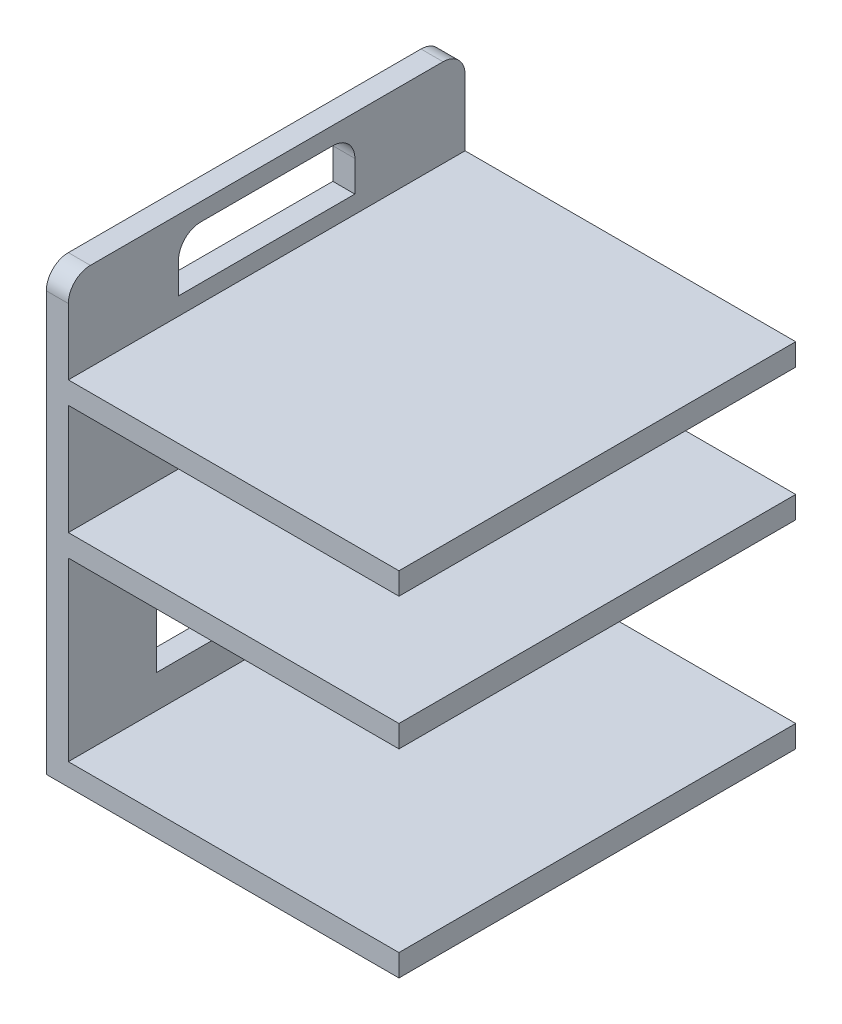
ISO-10303-21;
HEADER;
FILE_DESCRIPTION(('STEP AP214'),'2;1');
FILE_NAME('part.step','',(''),(''),'','','');
FILE_SCHEMA(('AUTOMOTIVE_DESIGN { 1 0 10303 214 1 1 1 1 }'));
ENDSEC;
DATA;
#1=APPLICATION_CONTEXT('core data for automotive mechanical design processes');
#2=APPLICATION_PROTOCOL_DEFINITION('international standard','automotive_design',2000,#1);
#3=PRODUCT_CONTEXT('',#1,'mechanical');
#4=PRODUCT('Part','Part','',(#3));
#5=PRODUCT_RELATED_PRODUCT_CATEGORY('part','',(#4));
#6=PRODUCT_DEFINITION_FORMATION('','',#4);
#7=PRODUCT_DEFINITION_CONTEXT('part definition',#1,'design');
#8=PRODUCT_DEFINITION('design','',#6,#7);
#9=PRODUCT_DEFINITION_SHAPE('','',#8);
#10=(LENGTH_UNIT() NAMED_UNIT(*) SI_UNIT(.MILLI.,.METRE.));
#11=(NAMED_UNIT(*) PLANE_ANGLE_UNIT() SI_UNIT($,.RADIAN.));
#12=(NAMED_UNIT(*) SI_UNIT($,.STERADIAN.) SOLID_ANGLE_UNIT());
#13=UNCERTAINTY_MEASURE_WITH_UNIT(LENGTH_MEASURE(1.E-05),#10,'distance_accuracy_value','');
#14=(GEOMETRIC_REPRESENTATION_CONTEXT(3) GLOBAL_UNCERTAINTY_ASSIGNED_CONTEXT((#13)) GLOBAL_UNIT_ASSIGNED_CONTEXT((#10,
#11,#12)) REPRESENTATION_CONTEXT('',''));
#15=CARTESIAN_POINT('',(0.,0.,0.));
#16=DIRECTION('',(0.,0.,1.));
#17=DIRECTION('',(1.,0.,0.));
#18=AXIS2_PLACEMENT_3D('',#15,#16,#17);
#19=CARTESIAN_POINT('',(5.,0.,0.));
#20=DIRECTION('',(1.,0.,0.));
#21=DIRECTION('',(0.,0.,-1.));
#22=AXIS2_PLACEMENT_3D('',#19,#20,#21);
#23=PLANE('',#22);
#24=DIRECTION('',(0.,-1.,0.));
#25=VECTOR('',#24,1.);
#26=CARTESIAN_POINT('',(5.,0.,-20.));
#27=LINE('',#26,#25);
#28=CARTESIAN_POINT('',(5.,-22.5,-20.));
#29=VERTEX_POINT('',#28);
#30=CARTESIAN_POINT('',(5.,-42.5,-20.));
#31=VERTEX_POINT('',#30);
#32=EDGE_CURVE('E259',#29,#31,#27,.T.);
#33=ORIENTED_EDGE('',*,*,#32,.F.);
#34=CARTESIAN_POINT('',(5.,-22.5,-25.));
#35=DIRECTION('',(1.,0.,0.));
#36=DIRECTION('',(0.,0.,-1.));
#37=AXIS2_PLACEMENT_3D('',#34,#35,#36);
#38=CIRCLE('',#37,5.);
#39=CARTESIAN_POINT('',(5.,-17.5,-25.));
#40=VERTEX_POINT('',#39);
#41=EDGE_CURVE('E499',#29,#40,#38,.F.);
#42=ORIENTED_EDGE('',*,*,#41,.T.);
#43=DIRECTION('',(0.,0.,-1.));
#44=VECTOR('',#43,1.);
#45=CARTESIAN_POINT('',(5.,-17.5,0.));
#46=LINE('',#45,#44);
#47=CARTESIAN_POINT('',(5.,-17.5,-65.));
#48=VERTEX_POINT('',#47);
#49=EDGE_CURVE('E264',#40,#48,#46,.T.);
#50=ORIENTED_EDGE('',*,*,#49,.T.);
#51=CARTESIAN_POINT('',(5.,-22.5,-65.));
#52=DIRECTION('',(1.,0.,0.));
#53=DIRECTION('',(0.,0.,-1.));
#54=AXIS2_PLACEMENT_3D('',#51,#52,#53);
#55=CIRCLE('',#54,5.);
#56=CARTESIAN_POINT('',(5.,-22.5,-70.));
#57=VERTEX_POINT('',#56);
#58=EDGE_CURVE('E502',#48,#57,#55,.F.);
#59=ORIENTED_EDGE('',*,*,#58,.T.);
#60=DIRECTION('',(0.,-1.,0.));
#61=VECTOR('',#60,1.);
#62=CARTESIAN_POINT('',(5.,0.,-70.));
#63=LINE('',#62,#61);
#64=CARTESIAN_POINT('',(5.,-42.5,-70.));
#65=VERTEX_POINT('',#64);
#66=EDGE_CURVE('E289',#57,#65,#63,.T.);
#67=ORIENTED_EDGE('',*,*,#66,.T.);
#68=DIRECTION('',(0.,0.,-1.));
#69=VECTOR('',#68,1.);
#70=CARTESIAN_POINT('',(5.,-42.5,0.));
#71=LINE('',#70,#69);
#72=EDGE_CURVE('E282',#31,#65,#71,.T.);
#73=ORIENTED_EDGE('',*,*,#72,.F.);
#74=EDGE_LOOP('',(#33,#42,#50,#59,#67,#73));
#75=FACE_BOUND('',#74,.T.);
#76=DIRECTION('',(0.,-1.,0.));
#77=VECTOR('',#76,1.);
#78=CARTESIAN_POINT('',(5.,0.,0.));
#79=LINE('',#78,#77);
#80=CARTESIAN_POINT('',(5.,-10.,0.));
#81=VERTEX_POINT('',#80);
#82=CARTESIAN_POINT('',(5.,-50.,0.));
#83=VERTEX_POINT('',#82);
#84=EDGE_CURVE('E426',#81,#83,#79,.T.);
#85=ORIENTED_EDGE('',*,*,#84,.T.);
#86=DIRECTION('',(0.,0.,1.));
#87=VECTOR('',#86,1.);
#88=CARTESIAN_POINT('',(5.,-50.,0.));
#89=LINE('',#88,#87);
#90=CARTESIAN_POINT('',(5.,-50.,-90.));
#91=VERTEX_POINT('',#90);
#92=EDGE_CURVE('E347',#91,#83,#89,.T.);
#93=ORIENTED_EDGE('',*,*,#92,.F.);
#94=DIRECTION('',(0.,-1.,0.));
#95=VECTOR('',#94,1.);
#96=CARTESIAN_POINT('',(5.,0.,-90.));
#97=LINE('',#96,#95);
#98=CARTESIAN_POINT('',(5.,-10.,-90.));
#99=VERTEX_POINT('',#98);
#100=EDGE_CURVE('E423',#99,#91,#97,.T.);
#101=ORIENTED_EDGE('',*,*,#100,.F.);
#102=DIRECTION('',(0.,0.,-1.));
#103=VECTOR('',#102,1.);
#104=CARTESIAN_POINT('',(5.,-10.,0.));
#105=LINE('',#104,#103);
#106=EDGE_CURVE('E372',#81,#99,#105,.T.);
#107=ORIENTED_EDGE('',*,*,#106,.F.);
#108=EDGE_LOOP('',(#85,#93,#101,#107));
#109=FACE_BOUND('',#108,.T.);
#110=ADVANCED_FACE('F32',(#75,#109),#23,.T.);
#111=DIRECTION('',(0.,-1.,0.));
#112=VECTOR('',#111,1.);
#113=CARTESIAN_POINT('',(5.,0.,-25.));
#114=LINE('',#113,#112);
#115=CARTESIAN_POINT('',(5.,36.,-25.));
#116=VERTEX_POINT('',#115);
#117=CARTESIAN_POINT('',(5.,29.,-25.));
#118=VERTEX_POINT('',#117);
#119=EDGE_CURVE('E328',#116,#118,#114,.T.);
#120=ORIENTED_EDGE('',*,*,#119,.F.);
#121=CARTESIAN_POINT('',(5.,36.,-30.));
#122=DIRECTION('',(1.,0.,0.));
#123=DIRECTION('',(0.,0.,-1.));
#124=AXIS2_PLACEMENT_3D('',#121,#122,#123);
#125=CIRCLE('',#124,5.);
#126=CARTESIAN_POINT('',(5.,41.,-30.));
#127=VERTEX_POINT('',#126);
#128=EDGE_CURVE('E477',#116,#127,#125,.F.);
#129=ORIENTED_EDGE('',*,*,#128,.T.);
#130=DIRECTION('',(0.,0.,-1.));
#131=VECTOR('',#130,1.);
#132=CARTESIAN_POINT('',(5.,41.,0.));
#133=LINE('',#132,#131);
#134=CARTESIAN_POINT('',(5.,41.,-60.));
#135=VERTEX_POINT('',#134);
#136=EDGE_CURVE('E335',#127,#135,#133,.T.);
#137=ORIENTED_EDGE('',*,*,#136,.T.);
#138=CARTESIAN_POINT('',(5.,36.,-60.));
#139=DIRECTION('',(1.,0.,0.));
#140=DIRECTION('',(0.,0.,-1.));
#141=AXIS2_PLACEMENT_3D('',#138,#139,#140);
#142=CIRCLE('',#141,5.);
#143=CARTESIAN_POINT('',(5.,36.,-65.));
#144=VERTEX_POINT('',#143);
#145=EDGE_CURVE('E473',#135,#144,#142,.F.);
#146=ORIENTED_EDGE('',*,*,#145,.T.);
#147=DIRECTION('',(0.,-1.,0.));
#148=VECTOR('',#147,1.);
#149=CARTESIAN_POINT('',(5.,0.,-65.));
#150=LINE('',#149,#148);
#151=CARTESIAN_POINT('',(5.,29.,-65.));
#152=VERTEX_POINT('',#151);
#153=EDGE_CURVE('E333',#144,#152,#150,.T.);
#154=ORIENTED_EDGE('',*,*,#153,.T.);
#155=DIRECTION('',(0.,0.,-1.));
#156=VECTOR('',#155,1.);
#157=CARTESIAN_POINT('',(5.,29.,0.));
#158=LINE('',#157,#156);
#159=EDGE_CURVE('E330',#118,#152,#158,.T.);
#160=ORIENTED_EDGE('',*,*,#159,.F.);
#161=EDGE_LOOP('',(#120,#129,#137,#146,#154,#160));
#162=FACE_BOUND('',#161,.T.);
#163=CARTESIAN_POINT('',(5.,40.,-90.));
#164=VERTEX_POINT('',#163);
#165=CARTESIAN_POINT('',(5.,25.,-90.));
#166=VERTEX_POINT('',#165);
#167=EDGE_CURVE('E419',#164,#166,#97,.T.);
#168=ORIENTED_EDGE('',*,*,#167,.F.);
#169=CARTESIAN_POINT('',(5.,40.,-85.));
#170=DIRECTION('',(1.,0.,0.));
#171=DIRECTION('',(0.,0.,-1.));
#172=AXIS2_PLACEMENT_3D('',#169,#170,#171);
#173=CIRCLE('',#172,5.);
#174=CARTESIAN_POINT('',(5.,45.,-85.));
#175=VERTEX_POINT('',#174);
#176=EDGE_CURVE('E468',#164,#175,#173,.T.);
#177=ORIENTED_EDGE('',*,*,#176,.T.);
#178=DIRECTION('',(0.,0.,-1.));
#179=VECTOR('',#178,1.);
#180=CARTESIAN_POINT('',(5.,45.,0.));
#181=LINE('',#180,#179);
#182=CARTESIAN_POINT('',(5.,45.,-5.));
#183=VERTEX_POINT('',#182);
#184=EDGE_CURVE('E421',#183,#175,#181,.T.);
#185=ORIENTED_EDGE('',*,*,#184,.F.);
#186=CARTESIAN_POINT('',(5.,40.,-5.));
#187=DIRECTION('',(1.,0.,0.));
#188=DIRECTION('',(0.,0.,-1.));
#189=AXIS2_PLACEMENT_3D('',#186,#187,#188);
#190=CIRCLE('',#189,5.);
#191=CARTESIAN_POINT('',(5.,40.,0.));
#192=VERTEX_POINT('',#191);
#193=EDGE_CURVE('E466',#183,#192,#190,.T.);
#194=ORIENTED_EDGE('',*,*,#193,.T.);
#195=CARTESIAN_POINT('',(5.,25.,0.));
#196=VERTEX_POINT('',#195);
#197=EDGE_CURVE('E427',#192,#196,#79,.T.);
#198=ORIENTED_EDGE('',*,*,#197,.T.);
#199=DIRECTION('',(0.,0.,-1.));
#200=VECTOR('',#199,1.);
#201=CARTESIAN_POINT('',(5.,25.,0.));
#202=LINE('',#201,#200);
#203=EDGE_CURVE('E395',#196,#166,#202,.T.);
#204=ORIENTED_EDGE('',*,*,#203,.T.);
#205=EDGE_LOOP('',(#168,#177,#185,#194,#198,#204));
#206=FACE_BOUND('',#205,.T.);
#207=ADVANCED_FACE('F545',(#162,#206),#23,.T.);
#208=CARTESIAN_POINT('',(5.,-55.,0.));
#209=DIRECTION('',(0.,-1.,0.));
#210=DIRECTION('',(0.,0.,-1.));
#211=AXIS2_PLACEMENT_3D('',#208,#209,#210);
#212=PLANE('',#211);
#213=DIRECTION('',(0.,0.,1.));
#214=VECTOR('',#213,1.);
#215=CARTESIAN_POINT('',(0.,-55.,0.));
#216=LINE('',#215,#214);
#217=CARTESIAN_POINT('',(0.,-55.,-90.));
#218=VERTEX_POINT('',#217);
#219=CARTESIAN_POINT('',(0.,-55.,0.));
#220=VERTEX_POINT('',#219);
#221=EDGE_CURVE('E418',#218,#220,#216,.T.);
#222=ORIENTED_EDGE('',*,*,#221,.F.);
#223=DIRECTION('',(-1.,0.,0.));
#224=VECTOR('',#223,1.);
#225=CARTESIAN_POINT('',(5.,-55.,-90.));
#226=LINE('',#225,#224);
#227=CARTESIAN_POINT('',(80.,-55.,-90.));
#228=VERTEX_POINT('',#227);
#229=EDGE_CURVE('E442',#228,#218,#226,.T.);
#230=ORIENTED_EDGE('',*,*,#229,.F.);
#231=DIRECTION('',(0.,0.,-1.));
#232=VECTOR('',#231,1.);
#233=CARTESIAN_POINT('',(80.,-55.,0.));
#234=LINE('',#233,#232);
#235=CARTESIAN_POINT('',(80.,-55.,0.));
#236=VERTEX_POINT('',#235);
#237=EDGE_CURVE('E356',#236,#228,#234,.T.);
#238=ORIENTED_EDGE('',*,*,#237,.F.);
#239=DIRECTION('',(-1.,0.,0.));
#240=VECTOR('',#239,1.);
#241=CARTESIAN_POINT('',(5.,-55.,0.));
#242=LINE('',#241,#240);
#243=EDGE_CURVE('E429',#236,#220,#242,.T.);
#244=ORIENTED_EDGE('',*,*,#243,.T.);
#245=EDGE_LOOP('',(#222,#230,#238,#244));
#246=FACE_BOUND('',#245,.T.);
#247=ADVANCED_FACE('F551',(#246),#212,.T.);
#248=CARTESIAN_POINT('',(5.,0.,-90.));
#249=DIRECTION('',(0.,0.,-1.));
#250=DIRECTION('',(-1.,0.,0.));
#251=AXIS2_PLACEMENT_3D('',#248,#249,#250);
#252=PLANE('',#251);
#253=DIRECTION('',(0.,-1.,0.));
#254=VECTOR('',#253,1.);
#255=CARTESIAN_POINT('',(0.,0.,-90.));
#256=LINE('',#255,#254);
#257=CARTESIAN_POINT('',(0.,40.,-90.));
#258=VERTEX_POINT('',#257);
#259=EDGE_CURVE('E433',#258,#218,#256,.T.);
#260=ORIENTED_EDGE('',*,*,#259,.F.);
#261=DIRECTION('',(-1.,0.,0.));
#262=VECTOR('',#261,1.);
#263=CARTESIAN_POINT('',(5.,40.,-90.));
#264=LINE('',#263,#262);
#265=EDGE_CURVE('E464',#258,#164,#264,.F.);
#266=ORIENTED_EDGE('',*,*,#265,.T.);
#267=ORIENTED_EDGE('',*,*,#167,.T.);
#268=DIRECTION('',(-1.,0.,0.));
#269=VECTOR('',#268,1.);
#270=CARTESIAN_POINT('',(80.,25.,-90.));
#271=LINE('',#270,#269);
#272=CARTESIAN_POINT('',(80.,25.,-90.));
#273=VERTEX_POINT('',#272);
#274=EDGE_CURVE('E409',#273,#166,#271,.T.);
#275=ORIENTED_EDGE('',*,*,#274,.F.);
#276=DIRECTION('',(0.,1.,0.));
#277=VECTOR('',#276,1.);
#278=CARTESIAN_POINT('',(80.,0.,-90.));
#279=LINE('',#278,#277);
#280=CARTESIAN_POINT('',(80.,20.,-90.));
#281=VERTEX_POINT('',#280);
#282=EDGE_CURVE('E397',#281,#273,#279,.T.);
#283=ORIENTED_EDGE('',*,*,#282,.F.);
#284=DIRECTION('',(-1.,0.,0.));
#285=VECTOR('',#284,1.);
#286=CARTESIAN_POINT('',(80.,20.,-90.));
#287=LINE('',#286,#285);
#288=CARTESIAN_POINT('',(5.,20.,-90.));
#289=VERTEX_POINT('',#288);
#290=EDGE_CURVE('E412',#281,#289,#287,.T.);
#291=ORIENTED_EDGE('',*,*,#290,.T.);
#292=CARTESIAN_POINT('',(5.,-5.00000000000004,-90.));
#293=VERTEX_POINT('',#292);
#294=EDGE_CURVE('E422',#289,#293,#97,.T.);
#295=ORIENTED_EDGE('',*,*,#294,.T.);
#296=DIRECTION('',(-1.,0.,0.));
#297=VECTOR('',#296,1.);
#298=CARTESIAN_POINT('',(80.,-5.00000000000004,-90.));
#299=LINE('',#298,#297);
#300=CARTESIAN_POINT('',(80.,-5.00000000000004,-90.));
#301=VERTEX_POINT('',#300);
#302=EDGE_CURVE('E378',#301,#293,#299,.T.);
#303=ORIENTED_EDGE('',*,*,#302,.F.);
#304=DIRECTION('',(0.,1.,0.));
#305=VECTOR('',#304,1.);
#306=CARTESIAN_POINT('',(80.,0.,-90.));
#307=LINE('',#306,#305);
#308=CARTESIAN_POINT('',(80.,-10.,-90.));
#309=VERTEX_POINT('',#308);
#310=EDGE_CURVE('E376',#309,#301,#307,.T.);
#311=ORIENTED_EDGE('',*,*,#310,.F.);
#312=DIRECTION('',(-1.,0.,0.));
#313=VECTOR('',#312,1.);
#314=CARTESIAN_POINT('',(80.,-10.,-90.));
#315=LINE('',#314,#313);
#316=EDGE_CURVE('E384',#309,#99,#315,.T.);
#317=ORIENTED_EDGE('',*,*,#316,.T.);
#318=ORIENTED_EDGE('',*,*,#100,.T.);
#319=DIRECTION('',(-1.,0.,0.));
#320=VECTOR('',#319,1.);
#321=CARTESIAN_POINT('',(80.,-50.,-90.));
#322=LINE('',#321,#320);
#323=CARTESIAN_POINT('',(80.,-50.,-90.));
#324=VERTEX_POINT('',#323);
#325=EDGE_CURVE('E364',#324,#91,#322,.T.);
#326=ORIENTED_EDGE('',*,*,#325,.F.);
#327=DIRECTION('',(0.,1.,0.));
#328=VECTOR('',#327,1.);
#329=CARTESIAN_POINT('',(80.,0.,-90.));
#330=LINE('',#329,#328);
#331=EDGE_CURVE('E348',#228,#324,#330,.T.);
#332=ORIENTED_EDGE('',*,*,#331,.F.);
#333=ORIENTED_EDGE('',*,*,#229,.T.);
#334=EDGE_LOOP('',(#260,#266,#267,#275,#283,#291,#295,#303,#311,#317,#318,#326,#332,#333));
#335=FACE_BOUND('',#334,.T.);
#336=ADVANCED_FACE('F569',(#335),#252,.T.);
#337=CARTESIAN_POINT('',(5.,45.,0.));
#338=DIRECTION('',(0.,1.,0.));
#339=DIRECTION('',(0.,0.,1.));
#340=AXIS2_PLACEMENT_3D('',#337,#338,#339);
#341=PLANE('',#340);
#342=ORIENTED_EDGE('',*,*,#184,.T.);
#343=DIRECTION('',(-1.,0.,0.));
#344=VECTOR('',#343,1.);
#345=CARTESIAN_POINT('',(5.,45.,-85.));
#346=LINE('',#345,#344);
#347=CARTESIAN_POINT('',(0.,45.,-85.));
#348=VERTEX_POINT('',#347);
#349=EDGE_CURVE('E457',#175,#348,#346,.T.);
#350=ORIENTED_EDGE('',*,*,#349,.T.);
#351=DIRECTION('',(0.,0.,-1.));
#352=VECTOR('',#351,1.);
#353=CARTESIAN_POINT('',(0.,45.,0.));
#354=LINE('',#353,#352);
#355=CARTESIAN_POINT('',(0.,45.,-5.));
#356=VERTEX_POINT('',#355);
#357=EDGE_CURVE('E435',#356,#348,#354,.T.);
#358=ORIENTED_EDGE('',*,*,#357,.F.);
#359=DIRECTION('',(-1.,0.,0.));
#360=VECTOR('',#359,1.);
#361=CARTESIAN_POINT('',(5.,45.,-5.));
#362=LINE('',#361,#360);
#363=EDGE_CURVE('E455',#356,#183,#362,.F.);
#364=ORIENTED_EDGE('',*,*,#363,.T.);
#365=EDGE_LOOP('',(#342,#350,#358,#364));
#366=FACE_BOUND('',#365,.T.);
#367=ADVANCED_FACE('F563',(#366),#341,.T.);
#368=CARTESIAN_POINT('',(5.,0.,0.));
#369=DIRECTION('',(0.,0.,-1.));
#370=DIRECTION('',(0.,1.,0.));
#371=AXIS2_PLACEMENT_3D('',#368,#369,#370);
#372=PLANE('',#371);
#373=ORIENTED_EDGE('',*,*,#197,.F.);
#374=DIRECTION('',(-1.,0.,0.));
#375=VECTOR('',#374,1.);
#376=CARTESIAN_POINT('',(0.,40.,0.));
#377=LINE('',#376,#375);
#378=CARTESIAN_POINT('',(0.,40.,0.));
#379=VERTEX_POINT('',#378);
#380=EDGE_CURVE('E470',#192,#379,#377,.T.);
#381=ORIENTED_EDGE('',*,*,#380,.T.);
#382=DIRECTION('',(0.,-1.,0.));
#383=VECTOR('',#382,1.);
#384=CARTESIAN_POINT('',(0.,0.,0.));
#385=LINE('',#384,#383);
#386=EDGE_CURVE('E438',#379,#220,#385,.T.);
#387=ORIENTED_EDGE('',*,*,#386,.T.);
#388=ORIENTED_EDGE('',*,*,#243,.F.);
#389=DIRECTION('',(0.,-1.,0.));
#390=VECTOR('',#389,1.);
#391=CARTESIAN_POINT('',(80.,0.,0.));
#392=LINE('',#391,#390);
#393=CARTESIAN_POINT('',(80.,-50.,0.));
#394=VERTEX_POINT('',#393);
#395=EDGE_CURVE('E353',#394,#236,#392,.T.);
#396=ORIENTED_EDGE('',*,*,#395,.F.);
#397=DIRECTION('',(-1.,0.,0.));
#398=VECTOR('',#397,1.);
#399=CARTESIAN_POINT('',(80.,-50.,0.));
#400=LINE('',#399,#398);
#401=EDGE_CURVE('E359',#394,#83,#400,.T.);
#402=ORIENTED_EDGE('',*,*,#401,.T.);
#403=ORIENTED_EDGE('',*,*,#84,.F.);
#404=DIRECTION('',(-1.,0.,0.));
#405=VECTOR('',#404,1.);
#406=CARTESIAN_POINT('',(80.,-10.,0.));
#407=LINE('',#406,#405);
#408=CARTESIAN_POINT('',(80.,-10.,0.));
#409=VERTEX_POINT('',#408);
#410=EDGE_CURVE('E386',#409,#81,#407,.T.);
#411=ORIENTED_EDGE('',*,*,#410,.F.);
#412=DIRECTION('',(0.,-1.,0.));
#413=VECTOR('',#412,1.);
#414=CARTESIAN_POINT('',(80.,0.,0.));
#415=LINE('',#414,#413);
#416=CARTESIAN_POINT('',(80.,-5.00000000000004,0.));
#417=VERTEX_POINT('',#416);
#418=EDGE_CURVE('E371',#417,#409,#415,.T.);
#419=ORIENTED_EDGE('',*,*,#418,.F.);
#420=DIRECTION('',(-1.,0.,0.));
#421=VECTOR('',#420,1.);
#422=CARTESIAN_POINT('',(80.,-5.00000000000004,0.));
#423=LINE('',#422,#421);
#424=CARTESIAN_POINT('',(5.,-5.00000000000004,0.));
#425=VERTEX_POINT('',#424);
#426=EDGE_CURVE('E388',#417,#425,#423,.T.);
#427=ORIENTED_EDGE('',*,*,#426,.T.);
#428=CARTESIAN_POINT('',(5.,20.,0.));
#429=VERTEX_POINT('',#428);
#430=EDGE_CURVE('E430',#429,#425,#79,.T.);
#431=ORIENTED_EDGE('',*,*,#430,.F.);
#432=DIRECTION('',(-1.,0.,0.));
#433=VECTOR('',#432,1.);
#434=CARTESIAN_POINT('',(80.,20.,0.));
#435=LINE('',#434,#433);
#436=CARTESIAN_POINT('',(80.,20.,0.));
#437=VERTEX_POINT('',#436);
#438=EDGE_CURVE('E415',#437,#429,#435,.T.);
#439=ORIENTED_EDGE('',*,*,#438,.F.);
#440=DIRECTION('',(0.,-1.,0.));
#441=VECTOR('',#440,1.);
#442=CARTESIAN_POINT('',(80.,0.,0.));
#443=LINE('',#442,#441);
#444=CARTESIAN_POINT('',(80.,25.,0.));
#445=VERTEX_POINT('',#444);
#446=EDGE_CURVE('E391',#445,#437,#443,.T.);
#447=ORIENTED_EDGE('',*,*,#446,.F.);
#448=DIRECTION('',(-1.,0.,0.));
#449=VECTOR('',#448,1.);
#450=CARTESIAN_POINT('',(80.,25.,0.));
#451=LINE('',#450,#449);
#452=EDGE_CURVE('E402',#445,#196,#451,.T.);
#453=ORIENTED_EDGE('',*,*,#452,.T.);
#454=EDGE_LOOP('',(#373,#381,#387,#388,#396,#402,#403,#411,#419,#427,#431,#439,#447,#453));
#455=FACE_BOUND('',#454,.T.);
#456=ADVANCED_FACE('F557',(#455),#372,.F.);
#457=DIRECTION('',(0.,-1.,0.));
#458=VECTOR('',#457,1.);
#459=CARTESIAN_POINT('',(5.,0.,-25.));
#460=LINE('',#459,#458);
#461=CARTESIAN_POINT('',(5.,8.5,-25.));
#462=VERTEX_POINT('',#461);
#463=CARTESIAN_POINT('',(5.,1.5,-25.));
#464=VERTEX_POINT('',#463);
#465=EDGE_CURVE('E301',#462,#464,#460,.T.);
#466=ORIENTED_EDGE('',*,*,#465,.F.);
#467=CARTESIAN_POINT('',(5.,8.5,-30.));
#468=DIRECTION('',(1.,0.,0.));
#469=DIRECTION('',(0.,0.,-1.));
#470=AXIS2_PLACEMENT_3D('',#467,#468,#469);
#471=CIRCLE('',#470,5.);
#472=CARTESIAN_POINT('',(5.,13.5,-30.));
#473=VERTEX_POINT('',#472);
#474=EDGE_CURVE('E506',#462,#473,#471,.F.);
#475=ORIENTED_EDGE('',*,*,#474,.T.);
#476=DIRECTION('',(0.,0.,-1.));
#477=VECTOR('',#476,1.);
#478=CARTESIAN_POINT('',(5.,13.5,0.));
#479=LINE('',#478,#477);
#480=CARTESIAN_POINT('',(5.,13.5,-60.));
#481=VERTEX_POINT('',#480);
#482=EDGE_CURVE('E308',#473,#481,#479,.T.);
#483=ORIENTED_EDGE('',*,*,#482,.T.);
#484=CARTESIAN_POINT('',(5.,8.5,-60.));
#485=DIRECTION('',(1.,0.,0.));
#486=DIRECTION('',(0.,0.,-1.));
#487=AXIS2_PLACEMENT_3D('',#484,#485,#486);
#488=CIRCLE('',#487,5.);
#489=CARTESIAN_POINT('',(5.,8.5,-65.));
#490=VERTEX_POINT('',#489);
#491=EDGE_CURVE('E40',#481,#490,#488,.F.);
#492=ORIENTED_EDGE('',*,*,#491,.T.);
#493=DIRECTION('',(0.,-1.,0.));
#494=VECTOR('',#493,1.);
#495=CARTESIAN_POINT('',(5.,0.,-65.));
#496=LINE('',#495,#494);
#497=CARTESIAN_POINT('',(5.,1.5,-65.));
#498=VERTEX_POINT('',#497);
#499=EDGE_CURVE('E306',#490,#498,#496,.T.);
#500=ORIENTED_EDGE('',*,*,#499,.T.);
#501=DIRECTION('',(0.,0.,-1.));
#502=VECTOR('',#501,1.);
#503=CARTESIAN_POINT('',(5.,1.5,0.));
#504=LINE('',#503,#502);
#505=EDGE_CURVE('E303',#464,#498,#504,.T.);
#506=ORIENTED_EDGE('',*,*,#505,.F.);
#507=EDGE_LOOP('',(#466,#475,#483,#492,#500,#506));
#508=FACE_BOUND('',#507,.T.);
#509=DIRECTION('',(0.,0.,-1.));
#510=VECTOR('',#509,1.);
#511=CARTESIAN_POINT('',(5.,-5.00000000000004,0.));
#512=LINE('',#511,#510);
#513=EDGE_CURVE('E367',#425,#293,#512,.T.);
#514=ORIENTED_EDGE('',*,*,#513,.T.);
#515=ORIENTED_EDGE('',*,*,#294,.F.);
#516=DIRECTION('',(0.,0.,-1.));
#517=VECTOR('',#516,1.);
#518=CARTESIAN_POINT('',(5.,20.,0.));
#519=LINE('',#518,#517);
#520=EDGE_CURVE('E390',#429,#289,#519,.T.);
#521=ORIENTED_EDGE('',*,*,#520,.F.);
#522=ORIENTED_EDGE('',*,*,#430,.T.);
#523=EDGE_LOOP('',(#514,#515,#521,#522));
#524=FACE_BOUND('',#523,.T.);
#525=ADVANCED_FACE('F522',(#508,#524),#23,.T.);
#526=CARTESIAN_POINT('',(0.,0.,0.));
#527=DIRECTION('',(1.,0.,0.));
#528=DIRECTION('',(0.,0.,-1.));
#529=AXIS2_PLACEMENT_3D('',#526,#527,#528);
#530=PLANE('',#529);
#531=DIRECTION('',(0.,1.,0.));
#532=VECTOR('',#531,1.);
#533=CARTESIAN_POINT('',(0.,0.,-70.));
#534=LINE('',#533,#532);
#535=CARTESIAN_POINT('',(0.,-42.5,-70.));
#536=VERTEX_POINT('',#535);
#537=CARTESIAN_POINT('',(0.,-22.5,-70.));
#538=VERTEX_POINT('',#537);
#539=EDGE_CURVE('E284',#536,#538,#534,.T.);
#540=ORIENTED_EDGE('',*,*,#539,.T.);
#541=CARTESIAN_POINT('',(0.,-22.5,-65.));
#542=DIRECTION('',(1.,0.,0.));
#543=DIRECTION('',(0.,0.,-1.));
#544=AXIS2_PLACEMENT_3D('',#541,#542,#543);
#545=CIRCLE('',#544,5.);
#546=CARTESIAN_POINT('',(0.,-17.5,-65.));
#547=VERTEX_POINT('',#546);
#548=EDGE_CURVE('E504',#538,#547,#545,.T.);
#549=ORIENTED_EDGE('',*,*,#548,.T.);
#550=DIRECTION('',(0.,0.,1.));
#551=VECTOR('',#550,1.);
#552=CARTESIAN_POINT('',(0.,-17.5,0.));
#553=LINE('',#552,#551);
#554=CARTESIAN_POINT('',(0.,-17.5,-25.));
#555=VERTEX_POINT('',#554);
#556=EDGE_CURVE('E280',#547,#555,#553,.T.);
#557=ORIENTED_EDGE('',*,*,#556,.T.);
#558=CARTESIAN_POINT('',(0.,-22.5,-25.));
#559=DIRECTION('',(1.,0.,0.));
#560=DIRECTION('',(0.,0.,-1.));
#561=AXIS2_PLACEMENT_3D('',#558,#559,#560);
#562=CIRCLE('',#561,5.);
#563=CARTESIAN_POINT('',(0.,-22.5,-20.));
#564=VERTEX_POINT('',#563);
#565=EDGE_CURVE('E279',#555,#564,#562,.T.);
#566=ORIENTED_EDGE('',*,*,#565,.T.);
#567=DIRECTION('',(0.,1.,0.));
#568=VECTOR('',#567,1.);
#569=CARTESIAN_POINT('',(0.,0.,-20.));
#570=LINE('',#569,#568);
#571=CARTESIAN_POINT('',(0.,-42.5,-20.));
#572=VERTEX_POINT('',#571);
#573=EDGE_CURVE('E256',#572,#564,#570,.T.);
#574=ORIENTED_EDGE('',*,*,#573,.F.);
#575=DIRECTION('',(0.,0.,1.));
#576=VECTOR('',#575,1.);
#577=CARTESIAN_POINT('',(0.,-42.5,0.));
#578=LINE('',#577,#576);
#579=EDGE_CURVE('E268',#536,#572,#578,.T.);
#580=ORIENTED_EDGE('',*,*,#579,.F.);
#581=EDGE_LOOP('',(#540,#549,#557,#566,#574,#580));
#582=FACE_BOUND('',#581,.T.);
#583=DIRECTION('',(0.,1.,0.));
#584=VECTOR('',#583,1.);
#585=CARTESIAN_POINT('',(0.,0.,-65.));
#586=LINE('',#585,#584);
#587=CARTESIAN_POINT('',(0.,1.5,-65.));
#588=VERTEX_POINT('',#587);
#589=CARTESIAN_POINT('',(0.,8.5,-65.));
#590=VERTEX_POINT('',#589);
#591=EDGE_CURVE('E273',#588,#590,#586,.T.);
#592=ORIENTED_EDGE('',*,*,#591,.T.);
#593=CARTESIAN_POINT('',(0.,8.5,-60.));
#594=DIRECTION('',(1.,0.,0.));
#595=DIRECTION('',(0.,0.,-1.));
#596=AXIS2_PLACEMENT_3D('',#593,#594,#595);
#597=CIRCLE('',#596,5.);
#598=CARTESIAN_POINT('',(0.,13.5,-60.));
#599=VERTEX_POINT('',#598);
#600=EDGE_CURVE('E11',#590,#599,#597,.T.);
#601=ORIENTED_EDGE('',*,*,#600,.T.);
#602=DIRECTION('',(0.,0.,1.));
#603=VECTOR('',#602,1.);
#604=CARTESIAN_POINT('',(0.,13.5,0.));
#605=LINE('',#604,#603);
#606=CARTESIAN_POINT('',(0.,13.5,-30.));
#607=VERTEX_POINT('',#606);
#608=EDGE_CURVE('E295',#599,#607,#605,.T.);
#609=ORIENTED_EDGE('',*,*,#608,.T.);
#610=CARTESIAN_POINT('',(0.,8.5,-30.));
#611=DIRECTION('',(1.,0.,0.));
#612=DIRECTION('',(0.,0.,-1.));
#613=AXIS2_PLACEMENT_3D('',#610,#611,#612);
#614=CIRCLE('',#613,5.);
#615=CARTESIAN_POINT('',(0.,8.5,-25.));
#616=VERTEX_POINT('',#615);
#617=EDGE_CURVE('E508',#607,#616,#614,.T.);
#618=ORIENTED_EDGE('',*,*,#617,.T.);
#619=DIRECTION('',(0.,1.,0.));
#620=VECTOR('',#619,1.);
#621=CARTESIAN_POINT('',(0.,0.,-25.));
#622=LINE('',#621,#620);
#623=CARTESIAN_POINT('',(0.,1.5,-25.));
#624=VERTEX_POINT('',#623);
#625=EDGE_CURVE('E298',#624,#616,#622,.T.);
#626=ORIENTED_EDGE('',*,*,#625,.F.);
#627=DIRECTION('',(0.,0.,1.));
#628=VECTOR('',#627,1.);
#629=CARTESIAN_POINT('',(0.,1.5,0.));
#630=LINE('',#629,#628);
#631=EDGE_CURVE('E314',#588,#624,#630,.T.);
#632=ORIENTED_EDGE('',*,*,#631,.F.);
#633=EDGE_LOOP('',(#592,#601,#609,#618,#626,#632));
#634=FACE_BOUND('',#633,.T.);
#635=DIRECTION('',(0.,1.,0.));
#636=VECTOR('',#635,1.);
#637=CARTESIAN_POINT('',(0.,0.,-65.));
#638=LINE('',#637,#636);
#639=CARTESIAN_POINT('',(0.,29.,-65.));
#640=VERTEX_POINT('',#639);
#641=CARTESIAN_POINT('',(0.,36.,-65.));
#642=VERTEX_POINT('',#641);
#643=EDGE_CURVE('E319',#640,#642,#638,.T.);
#644=ORIENTED_EDGE('',*,*,#643,.T.);
#645=CARTESIAN_POINT('',(0.,36.,-60.));
#646=DIRECTION('',(1.,0.,0.));
#647=DIRECTION('',(0.,0.,-1.));
#648=AXIS2_PLACEMENT_3D('',#645,#646,#647);
#649=CIRCLE('',#648,5.);
#650=CARTESIAN_POINT('',(0.,41.,-60.));
#651=VERTEX_POINT('',#650);
#652=EDGE_CURVE('E475',#642,#651,#649,.T.);
#653=ORIENTED_EDGE('',*,*,#652,.T.);
#654=DIRECTION('',(0.,0.,1.));
#655=VECTOR('',#654,1.);
#656=CARTESIAN_POINT('',(0.,41.,0.));
#657=LINE('',#656,#655);
#658=CARTESIAN_POINT('',(0.,41.,-30.));
#659=VERTEX_POINT('',#658);
#660=EDGE_CURVE('E322',#651,#659,#657,.T.);
#661=ORIENTED_EDGE('',*,*,#660,.T.);
#662=CARTESIAN_POINT('',(0.,36.,-30.));
#663=DIRECTION('',(1.,0.,0.));
#664=DIRECTION('',(0.,0.,-1.));
#665=AXIS2_PLACEMENT_3D('',#662,#663,#664);
#666=CIRCLE('',#665,5.);
#667=CARTESIAN_POINT('',(0.,36.,-25.));
#668=VERTEX_POINT('',#667);
#669=EDGE_CURVE('E479',#659,#668,#666,.T.);
#670=ORIENTED_EDGE('',*,*,#669,.T.);
#671=DIRECTION('',(0.,1.,0.));
#672=VECTOR('',#671,1.);
#673=CARTESIAN_POINT('',(0.,0.,-25.));
#674=LINE('',#673,#672);
#675=CARTESIAN_POINT('',(0.,29.,-25.));
#676=VERTEX_POINT('',#675);
#677=EDGE_CURVE('E325',#676,#668,#674,.T.);
#678=ORIENTED_EDGE('',*,*,#677,.F.);
#679=DIRECTION('',(0.,0.,1.));
#680=VECTOR('',#679,1.);
#681=CARTESIAN_POINT('',(0.,29.,0.));
#682=LINE('',#681,#680);
#683=EDGE_CURVE('E342',#640,#676,#682,.T.);
#684=ORIENTED_EDGE('',*,*,#683,.F.);
#685=EDGE_LOOP('',(#644,#653,#661,#670,#678,#684));
#686=FACE_BOUND('',#685,.T.);
#687=ORIENTED_EDGE('',*,*,#357,.T.);
#688=CARTESIAN_POINT('',(0.,40.,-85.));
#689=DIRECTION('',(1.,0.,0.));
#690=DIRECTION('',(0.,0.,-1.));
#691=AXIS2_PLACEMENT_3D('',#688,#689,#690);
#692=CIRCLE('',#691,5.);
#693=EDGE_CURVE('E462',#348,#258,#692,.F.);
#694=ORIENTED_EDGE('',*,*,#693,.T.);
#695=ORIENTED_EDGE('',*,*,#259,.T.);
#696=ORIENTED_EDGE('',*,*,#221,.T.);
#697=ORIENTED_EDGE('',*,*,#386,.F.);
#698=CARTESIAN_POINT('',(0.,40.,-5.));
#699=DIRECTION('',(1.,0.,0.));
#700=DIRECTION('',(0.,0.,-1.));
#701=AXIS2_PLACEMENT_3D('',#698,#699,#700);
#702=CIRCLE('',#701,5.);
#703=EDGE_CURVE('E460',#379,#356,#702,.F.);
#704=ORIENTED_EDGE('',*,*,#703,.T.);
#705=EDGE_LOOP('',(#687,#694,#695,#696,#697,#704));
#706=FACE_BOUND('',#705,.T.);
#707=ADVANCED_FACE('F275',(#582,#634,#686,#706),#530,.F.);
#708=CARTESIAN_POINT('',(80.,20.,0.));
#709=DIRECTION('',(0.,1.,0.));
#710=DIRECTION('',(0.,0.,1.));
#711=AXIS2_PLACEMENT_3D('',#708,#709,#710);
#712=PLANE('',#711);
#713=ORIENTED_EDGE('',*,*,#520,.T.);
#714=ORIENTED_EDGE('',*,*,#290,.F.);
#715=DIRECTION('',(0.,0.,-1.));
#716=VECTOR('',#715,1.);
#717=CARTESIAN_POINT('',(80.,20.,0.));
#718=LINE('',#717,#716);
#719=EDGE_CURVE('E394',#437,#281,#718,.T.);
#720=ORIENTED_EDGE('',*,*,#719,.F.);
#721=ORIENTED_EDGE('',*,*,#438,.T.);
#722=EDGE_LOOP('',(#713,#714,#720,#721));
#723=FACE_BOUND('',#722,.T.);
#724=ADVANCED_FACE('F562',(#723),#712,.F.);
#725=CARTESIAN_POINT('',(80.,25.,0.));
#726=DIRECTION('',(0.,1.,0.));
#727=DIRECTION('',(0.,0.,1.));
#728=AXIS2_PLACEMENT_3D('',#725,#726,#727);
#729=PLANE('',#728);
#730=ORIENTED_EDGE('',*,*,#203,.F.);
#731=ORIENTED_EDGE('',*,*,#452,.F.);
#732=DIRECTION('',(0.,0.,-1.));
#733=VECTOR('',#732,1.);
#734=CARTESIAN_POINT('',(80.,25.,0.));
#735=LINE('',#734,#733);
#736=EDGE_CURVE('E399',#445,#273,#735,.T.);
#737=ORIENTED_EDGE('',*,*,#736,.T.);
#738=ORIENTED_EDGE('',*,*,#274,.T.);
#739=EDGE_LOOP('',(#730,#731,#737,#738));
#740=FACE_BOUND('',#739,.T.);
#741=ADVANCED_FACE('F852',(#740),#729,.T.);
#742=CARTESIAN_POINT('',(80.,0.,0.));
#743=DIRECTION('',(1.,0.,0.));
#744=DIRECTION('',(0.,0.,-1.));
#745=AXIS2_PLACEMENT_3D('',#742,#743,#744);
#746=PLANE('',#745);
#747=ORIENTED_EDGE('',*,*,#446,.T.);
#748=ORIENTED_EDGE('',*,*,#719,.T.);
#749=ORIENTED_EDGE('',*,*,#282,.T.);
#750=ORIENTED_EDGE('',*,*,#736,.F.);
#751=EDGE_LOOP('',(#747,#748,#749,#750));
#752=FACE_BOUND('',#751,.T.);
#753=ADVANCED_FACE('F842',(#752),#746,.T.);
#754=CARTESIAN_POINT('',(80.,-5.00000000000004,0.));
#755=DIRECTION('',(0.,1.,0.));
#756=DIRECTION('',(0.,0.,1.));
#757=AXIS2_PLACEMENT_3D('',#754,#755,#756);
#758=PLANE('',#757);
#759=ORIENTED_EDGE('',*,*,#513,.F.);
#760=ORIENTED_EDGE('',*,*,#426,.F.);
#761=DIRECTION('',(0.,0.,-1.));
#762=VECTOR('',#761,1.);
#763=CARTESIAN_POINT('',(80.,-5.00000000000004,0.));
#764=LINE('',#763,#762);
#765=EDGE_CURVE('E368',#417,#301,#764,.T.);
#766=ORIENTED_EDGE('',*,*,#765,.T.);
#767=ORIENTED_EDGE('',*,*,#302,.T.);
#768=EDGE_LOOP('',(#759,#760,#766,#767));
#769=FACE_BOUND('',#768,.T.);
#770=ADVANCED_FACE('F832',(#769),#758,.T.);
#771=CARTESIAN_POINT('',(80.,-10.,0.));
#772=DIRECTION('',(0.,1.,0.));
#773=DIRECTION('',(0.,0.,1.));
#774=AXIS2_PLACEMENT_3D('',#771,#772,#773);
#775=PLANE('',#774);
#776=ORIENTED_EDGE('',*,*,#106,.T.);
#777=ORIENTED_EDGE('',*,*,#316,.F.);
#778=DIRECTION('',(0.,0.,-1.));
#779=VECTOR('',#778,1.);
#780=CARTESIAN_POINT('',(80.,-10.,0.));
#781=LINE('',#780,#779);
#782=EDGE_CURVE('E374',#409,#309,#781,.T.);
#783=ORIENTED_EDGE('',*,*,#782,.F.);
#784=ORIENTED_EDGE('',*,*,#410,.T.);
#785=EDGE_LOOP('',(#776,#777,#783,#784));
#786=FACE_BOUND('',#785,.T.);
#787=ADVANCED_FACE('F822',(#786),#775,.F.);
#788=CARTESIAN_POINT('',(80.,0.,0.));
#789=DIRECTION('',(1.,0.,0.));
#790=DIRECTION('',(0.,0.,-1.));
#791=AXIS2_PLACEMENT_3D('',#788,#789,#790);
#792=PLANE('',#791);
#793=ORIENTED_EDGE('',*,*,#765,.F.);
#794=ORIENTED_EDGE('',*,*,#418,.T.);
#795=ORIENTED_EDGE('',*,*,#782,.T.);
#796=ORIENTED_EDGE('',*,*,#310,.T.);
#797=EDGE_LOOP('',(#793,#794,#795,#796));
#798=FACE_BOUND('',#797,.T.);
#799=ADVANCED_FACE('F812',(#798),#792,.T.);
#800=CARTESIAN_POINT('',(80.,-50.,0.));
#801=DIRECTION('',(0.,-1.,0.));
#802=DIRECTION('',(0.,0.,-1.));
#803=AXIS2_PLACEMENT_3D('',#800,#801,#802);
#804=PLANE('',#803);
#805=ORIENTED_EDGE('',*,*,#92,.T.);
#806=ORIENTED_EDGE('',*,*,#401,.F.);
#807=DIRECTION('',(0.,0.,1.));
#808=VECTOR('',#807,1.);
#809=CARTESIAN_POINT('',(80.,-50.,0.));
#810=LINE('',#809,#808);
#811=EDGE_CURVE('E351',#324,#394,#810,.T.);
#812=ORIENTED_EDGE('',*,*,#811,.F.);
#813=ORIENTED_EDGE('',*,*,#325,.T.);
#814=EDGE_LOOP('',(#805,#806,#812,#813));
#815=FACE_BOUND('',#814,.T.);
#816=ADVANCED_FACE('F802',(#815),#804,.F.);
#817=CARTESIAN_POINT('',(80.,0.,0.));
#818=DIRECTION('',(1.,0.,0.));
#819=DIRECTION('',(0.,0.,-1.));
#820=AXIS2_PLACEMENT_3D('',#817,#818,#819);
#821=PLANE('',#820);
#822=ORIENTED_EDGE('',*,*,#331,.T.);
#823=ORIENTED_EDGE('',*,*,#811,.T.);
#824=ORIENTED_EDGE('',*,*,#395,.T.);
#825=ORIENTED_EDGE('',*,*,#237,.T.);
#826=EDGE_LOOP('',(#822,#823,#824,#825));
#827=FACE_BOUND('',#826,.T.);
#828=ADVANCED_FACE('F748',(#827),#821,.T.);
#829=CARTESIAN_POINT('',(-0.00100000000000013,0.,-25.));
#830=DIRECTION('',(0.,0.,1.));
#831=DIRECTION('',(1.,0.,0.));
#832=AXIS2_PLACEMENT_3D('',#829,#830,#831);
#833=PLANE('',#832);
#834=ORIENTED_EDGE('',*,*,#677,.T.);
#835=DIRECTION('',(1.,0.,0.));
#836=VECTOR('',#835,1.);
#837=CARTESIAN_POINT('',(-0.00100000000000013,36.,-25.));
#838=LINE('',#837,#836);
#839=EDGE_CURVE('E452',#668,#116,#838,.T.);
#840=ORIENTED_EDGE('',*,*,#839,.T.);
#841=ORIENTED_EDGE('',*,*,#119,.T.);
#842=DIRECTION('',(1.,0.,0.));
#843=VECTOR('',#842,1.);
#844=CARTESIAN_POINT('',(-0.00100000000000013,29.,-25.));
#845=LINE('',#844,#843);
#846=EDGE_CURVE('E338',#676,#118,#845,.T.);
#847=ORIENTED_EDGE('',*,*,#846,.F.);
#848=EDGE_LOOP('',(#834,#840,#841,#847));
#849=FACE_BOUND('',#848,.T.);
#850=ADVANCED_FACE('F739',(#849),#833,.F.);
#851=CARTESIAN_POINT('',(-0.00100000000000013,41.,0.));
#852=DIRECTION('',(0.,-1.,0.));
#853=DIRECTION('',(0.,0.,-1.));
#854=AXIS2_PLACEMENT_3D('',#851,#852,#853);
#855=PLANE('',#854);
#856=ORIENTED_EDGE('',*,*,#660,.F.);
#857=DIRECTION('',(1.,0.,0.));
#858=VECTOR('',#857,1.);
#859=CARTESIAN_POINT('',(5.,41.,-60.));
#860=LINE('',#859,#858);
#861=EDGE_CURVE('E447',#651,#135,#860,.T.);
#862=ORIENTED_EDGE('',*,*,#861,.T.);
#863=ORIENTED_EDGE('',*,*,#136,.F.);
#864=DIRECTION('',(1.,0.,0.));
#865=VECTOR('',#864,1.);
#866=CARTESIAN_POINT('',(-0.00100000000000013,41.,-30.));
#867=LINE('',#866,#865);
#868=EDGE_CURVE('E445',#127,#659,#867,.F.);
#869=ORIENTED_EDGE('',*,*,#868,.T.);
#870=EDGE_LOOP('',(#856,#862,#863,#869));
#871=FACE_BOUND('',#870,.T.);
#872=ADVANCED_FACE('F729',(#871),#855,.T.);
#873=CARTESIAN_POINT('',(-0.00100000000000013,0.,-65.));
#874=DIRECTION('',(0.,0.,1.));
#875=DIRECTION('',(1.,0.,0.));
#876=AXIS2_PLACEMENT_3D('',#873,#874,#875);
#877=PLANE('',#876);
#878=ORIENTED_EDGE('',*,*,#153,.F.);
#879=DIRECTION('',(1.,0.,0.));
#880=VECTOR('',#879,1.);
#881=CARTESIAN_POINT('',(0.,36.,-65.));
#882=LINE('',#881,#880);
#883=EDGE_CURVE('E450',#144,#642,#882,.F.);
#884=ORIENTED_EDGE('',*,*,#883,.T.);
#885=ORIENTED_EDGE('',*,*,#643,.F.);
#886=DIRECTION('',(1.,0.,0.));
#887=VECTOR('',#886,1.);
#888=CARTESIAN_POINT('',(-0.00100000000000013,29.,-65.));
#889=LINE('',#888,#887);
#890=EDGE_CURVE('E339',#640,#152,#889,.T.);
#891=ORIENTED_EDGE('',*,*,#890,.T.);
#892=EDGE_LOOP('',(#878,#884,#885,#891));
#893=FACE_BOUND('',#892,.T.);
#894=ADVANCED_FACE('F724',(#893),#877,.T.);
#895=CARTESIAN_POINT('',(-0.00100000000000013,29.,0.));
#896=DIRECTION('',(0.,-1.,0.));
#897=DIRECTION('',(0.,0.,-1.));
#898=AXIS2_PLACEMENT_3D('',#895,#896,#897);
#899=PLANE('',#898);
#900=ORIENTED_EDGE('',*,*,#683,.T.);
#901=ORIENTED_EDGE('',*,*,#846,.T.);
#902=ORIENTED_EDGE('',*,*,#159,.T.);
#903=ORIENTED_EDGE('',*,*,#890,.F.);
#904=EDGE_LOOP('',(#900,#901,#902,#903));
#905=FACE_BOUND('',#904,.T.);
#906=ADVANCED_FACE('F677',(#905),#899,.F.);
#907=CARTESIAN_POINT('',(-0.00100000000000013,0.,-25.));
#908=DIRECTION('',(0.,0.,1.));
#909=DIRECTION('',(1.,0.,0.));
#910=AXIS2_PLACEMENT_3D('',#907,#908,#909);
#911=PLANE('',#910);
#912=ORIENTED_EDGE('',*,*,#625,.T.);
#913=DIRECTION('',(1.,0.,0.));
#914=VECTOR('',#913,1.);
#915=CARTESIAN_POINT('',(-0.00100000000000013,8.5,-25.));
#916=LINE('',#915,#914);
#917=EDGE_CURVE('E490',#616,#462,#916,.T.);
#918=ORIENTED_EDGE('',*,*,#917,.T.);
#919=ORIENTED_EDGE('',*,*,#465,.T.);
#920=DIRECTION('',(1.,0.,0.));
#921=VECTOR('',#920,1.);
#922=CARTESIAN_POINT('',(-0.00100000000000013,1.5,-25.));
#923=LINE('',#922,#921);
#924=EDGE_CURVE('E310',#624,#464,#923,.T.);
#925=ORIENTED_EDGE('',*,*,#924,.F.);
#926=EDGE_LOOP('',(#912,#918,#919,#925));
#927=FACE_BOUND('',#926,.T.);
#928=ADVANCED_FACE('F518',(#927),#911,.F.);
#929=CARTESIAN_POINT('',(-0.00100000000000013,13.5,0.));
#930=DIRECTION('',(0.,-1.,0.));
#931=DIRECTION('',(0.,0.,-1.));
#932=AXIS2_PLACEMENT_3D('',#929,#930,#931);
#933=PLANE('',#932);
#934=ORIENTED_EDGE('',*,*,#482,.F.);
#935=DIRECTION('',(1.,0.,0.));
#936=VECTOR('',#935,1.);
#937=CARTESIAN_POINT('',(-0.00100000000000013,13.5,-30.));
#938=LINE('',#937,#936);
#939=EDGE_CURVE('E496',#473,#607,#938,.F.);
#940=ORIENTED_EDGE('',*,*,#939,.T.);
#941=ORIENTED_EDGE('',*,*,#608,.F.);
#942=DIRECTION('',(1.,0.,0.));
#943=VECTOR('',#942,1.);
#944=CARTESIAN_POINT('',(5.,13.5,-60.));
#945=LINE('',#944,#943);
#946=EDGE_CURVE('E493',#599,#481,#945,.T.);
#947=ORIENTED_EDGE('',*,*,#946,.T.);
#948=EDGE_LOOP('',(#934,#940,#941,#947));
#949=FACE_BOUND('',#948,.T.);
#950=ADVANCED_FACE('F526',(#949),#933,.T.);
#951=CARTESIAN_POINT('',(-0.00100000000000013,0.,-65.));
#952=DIRECTION('',(0.,0.,1.));
#953=DIRECTION('',(1.,0.,0.));
#954=AXIS2_PLACEMENT_3D('',#951,#952,#953);
#955=PLANE('',#954);
#956=ORIENTED_EDGE('',*,*,#499,.F.);
#957=DIRECTION('',(1.,0.,0.));
#958=VECTOR('',#957,1.);
#959=CARTESIAN_POINT('',(0.,8.5,-65.));
#960=LINE('',#959,#958);
#961=EDGE_CURVE('E47',#490,#590,#960,.F.);
#962=ORIENTED_EDGE('',*,*,#961,.T.);
#963=ORIENTED_EDGE('',*,*,#591,.F.);
#964=DIRECTION('',(1.,0.,0.));
#965=VECTOR('',#964,1.);
#966=CARTESIAN_POINT('',(-0.00100000000000013,1.5,-65.));
#967=LINE('',#966,#965);
#968=EDGE_CURVE('E311',#588,#498,#967,.T.);
#969=ORIENTED_EDGE('',*,*,#968,.T.);
#970=EDGE_LOOP('',(#956,#962,#963,#969));
#971=FACE_BOUND('',#970,.T.);
#972=ADVANCED_FACE('F531',(#971),#955,.T.);
#973=CARTESIAN_POINT('',(-0.00100000000000013,1.5,0.));
#974=DIRECTION('',(0.,-1.,0.));
#975=DIRECTION('',(0.,0.,-1.));
#976=AXIS2_PLACEMENT_3D('',#973,#974,#975);
#977=PLANE('',#976);
#978=ORIENTED_EDGE('',*,*,#631,.T.);
#979=ORIENTED_EDGE('',*,*,#924,.T.);
#980=ORIENTED_EDGE('',*,*,#505,.T.);
#981=ORIENTED_EDGE('',*,*,#968,.F.);
#982=EDGE_LOOP('',(#978,#979,#980,#981));
#983=FACE_BOUND('',#982,.T.);
#984=ADVANCED_FACE('F533',(#983),#977,.F.);
#985=CARTESIAN_POINT('',(-0.00100000000000013,0.,-20.));
#986=DIRECTION('',(0.,0.,1.));
#987=DIRECTION('',(1.,0.,0.));
#988=AXIS2_PLACEMENT_3D('',#985,#986,#987);
#989=PLANE('',#988);
#990=ORIENTED_EDGE('',*,*,#573,.T.);
#991=DIRECTION('',(1.,0.,0.));
#992=VECTOR('',#991,1.);
#993=CARTESIAN_POINT('',(-0.00100000000000013,-22.5,-20.));
#994=LINE('',#993,#992);
#995=EDGE_CURVE('E481',#564,#29,#994,.T.);
#996=ORIENTED_EDGE('',*,*,#995,.T.);
#997=ORIENTED_EDGE('',*,*,#32,.T.);
#998=DIRECTION('',(1.,0.,0.));
#999=VECTOR('',#998,1.);
#1000=CARTESIAN_POINT('',(-0.00100000000000013,-42.5,-20.));
#1001=LINE('',#1000,#999);
#1002=EDGE_CURVE('E251',#572,#31,#1001,.T.);
#1003=ORIENTED_EDGE('',*,*,#1002,.F.);
#1004=EDGE_LOOP('',(#990,#996,#997,#1003));
#1005=FACE_BOUND('',#1004,.T.);
#1006=ADVANCED_FACE('F253',(#1005),#989,.F.);
#1007=CARTESIAN_POINT('',(-0.00100000000000013,-17.5,0.));
#1008=DIRECTION('',(0.,-1.,0.));
#1009=DIRECTION('',(0.,0.,-1.));
#1010=AXIS2_PLACEMENT_3D('',#1007,#1008,#1009);
#1011=PLANE('',#1010);
#1012=ORIENTED_EDGE('',*,*,#49,.F.);
#1013=DIRECTION('',(1.,0.,0.));
#1014=VECTOR('',#1013,1.);
#1015=CARTESIAN_POINT('',(-0.00100000000000013,-17.5,-25.));
#1016=LINE('',#1015,#1014);
#1017=EDGE_CURVE('E486',#40,#555,#1016,.F.);
#1018=ORIENTED_EDGE('',*,*,#1017,.T.);
#1019=ORIENTED_EDGE('',*,*,#556,.F.);
#1020=DIRECTION('',(1.,0.,0.));
#1021=VECTOR('',#1020,1.);
#1022=CARTESIAN_POINT('',(5.,-17.5,-65.));
#1023=LINE('',#1022,#1021);
#1024=EDGE_CURVE('E483',#547,#48,#1023,.T.);
#1025=ORIENTED_EDGE('',*,*,#1024,.T.);
#1026=EDGE_LOOP('',(#1012,#1018,#1019,#1025));
#1027=FACE_BOUND('',#1026,.T.);
#1028=ADVANCED_FACE('F540',(#1027),#1011,.T.);
#1029=CARTESIAN_POINT('',(-0.00100000000000013,0.,-70.));
#1030=DIRECTION('',(0.,0.,1.));
#1031=DIRECTION('',(1.,0.,0.));
#1032=AXIS2_PLACEMENT_3D('',#1029,#1030,#1031);
#1033=PLANE('',#1032);
#1034=ORIENTED_EDGE('',*,*,#66,.F.);
#1035=DIRECTION('',(1.,0.,0.));
#1036=VECTOR('',#1035,1.);
#1037=CARTESIAN_POINT('',(0.,-22.5,-70.));
#1038=LINE('',#1037,#1036);
#1039=EDGE_CURVE('E488',#57,#538,#1038,.F.);
#1040=ORIENTED_EDGE('',*,*,#1039,.T.);
#1041=ORIENTED_EDGE('',*,*,#539,.F.);
#1042=DIRECTION('',(1.,0.,0.));
#1043=VECTOR('',#1042,1.);
#1044=CARTESIAN_POINT('',(-0.00100000000000013,-42.5,-70.));
#1045=LINE('',#1044,#1043);
#1046=EDGE_CURVE('E263',#536,#65,#1045,.T.);
#1047=ORIENTED_EDGE('',*,*,#1046,.T.);
#1048=EDGE_LOOP('',(#1034,#1040,#1041,#1047));
#1049=FACE_BOUND('',#1048,.T.);
#1050=ADVANCED_FACE('F631',(#1049),#1033,.T.);
#1051=CARTESIAN_POINT('',(-0.00100000000000013,-42.5,0.));
#1052=DIRECTION('',(0.,-1.,0.));
#1053=DIRECTION('',(0.,0.,-1.));
#1054=AXIS2_PLACEMENT_3D('',#1051,#1052,#1053);
#1055=PLANE('',#1054);
#1056=ORIENTED_EDGE('',*,*,#579,.T.);
#1057=ORIENTED_EDGE('',*,*,#1002,.T.);
#1058=ORIENTED_EDGE('',*,*,#72,.T.);
#1059=ORIENTED_EDGE('',*,*,#1046,.F.);
#1060=EDGE_LOOP('',(#1056,#1057,#1058,#1059));
#1061=FACE_BOUND('',#1060,.T.);
#1062=ADVANCED_FACE('F269',(#1061),#1055,.F.);
#1063=CARTESIAN_POINT('',(-0.00100000000000013,36.,-60.));
#1064=DIRECTION('',(-1.,0.,0.));
#1065=DIRECTION('',(0.,0.,1.));
#1066=AXIS2_PLACEMENT_3D('',#1063,#1064,#1065);
#1067=CYLINDRICAL_SURFACE('',#1066,5.);
#1068=ORIENTED_EDGE('',*,*,#652,.F.);
#1069=ORIENTED_EDGE('',*,*,#883,.F.);
#1070=ORIENTED_EDGE('',*,*,#145,.F.);
#1071=ORIENTED_EDGE('',*,*,#861,.F.);
#1072=EDGE_LOOP('',(#1068,#1069,#1070,#1071));
#1073=FACE_BOUND('',#1072,.T.);
#1074=ADVANCED_FACE('F580',(#1073),#1067,.F.);
#1075=CARTESIAN_POINT('',(-0.00100000000000013,36.,-30.));
#1076=DIRECTION('',(1.,0.,0.));
#1077=DIRECTION('',(0.,0.,-1.));
#1078=AXIS2_PLACEMENT_3D('',#1075,#1076,#1077);
#1079=CYLINDRICAL_SURFACE('',#1078,5.);
#1080=ORIENTED_EDGE('',*,*,#669,.F.);
#1081=ORIENTED_EDGE('',*,*,#868,.F.);
#1082=ORIENTED_EDGE('',*,*,#128,.F.);
#1083=ORIENTED_EDGE('',*,*,#839,.F.);
#1084=EDGE_LOOP('',(#1080,#1081,#1082,#1083));
#1085=FACE_BOUND('',#1084,.T.);
#1086=ADVANCED_FACE('F583',(#1085),#1079,.F.);
#1087=CARTESIAN_POINT('',(5.,40.,-85.));
#1088=DIRECTION('',(-1.,0.,0.));
#1089=DIRECTION('',(0.,0.,1.));
#1090=AXIS2_PLACEMENT_3D('',#1087,#1088,#1089);
#1091=CYLINDRICAL_SURFACE('',#1090,5.);
#1092=ORIENTED_EDGE('',*,*,#176,.F.);
#1093=ORIENTED_EDGE('',*,*,#265,.F.);
#1094=ORIENTED_EDGE('',*,*,#693,.F.);
#1095=ORIENTED_EDGE('',*,*,#349,.F.);
#1096=EDGE_LOOP('',(#1092,#1093,#1094,#1095));
#1097=FACE_BOUND('',#1096,.T.);
#1098=ADVANCED_FACE('F587',(#1097),#1091,.T.);
#1099=CARTESIAN_POINT('',(5.,40.,-5.));
#1100=DIRECTION('',(1.,0.,0.));
#1101=DIRECTION('',(0.,0.,-1.));
#1102=AXIS2_PLACEMENT_3D('',#1099,#1100,#1101);
#1103=CYLINDRICAL_SURFACE('',#1102,5.);
#1104=ORIENTED_EDGE('',*,*,#193,.F.);
#1105=ORIENTED_EDGE('',*,*,#363,.F.);
#1106=ORIENTED_EDGE('',*,*,#703,.F.);
#1107=ORIENTED_EDGE('',*,*,#380,.F.);
#1108=EDGE_LOOP('',(#1104,#1105,#1106,#1107));
#1109=FACE_BOUND('',#1108,.T.);
#1110=ADVANCED_FACE('F591',(#1109),#1103,.T.);
#1111=CARTESIAN_POINT('',(-0.00100000000000013,-22.5,-25.));
#1112=DIRECTION('',(1.,0.,0.));
#1113=DIRECTION('',(0.,0.,-1.));
#1114=AXIS2_PLACEMENT_3D('',#1111,#1112,#1113);
#1115=CYLINDRICAL_SURFACE('',#1114,5.);
#1116=ORIENTED_EDGE('',*,*,#565,.F.);
#1117=ORIENTED_EDGE('',*,*,#1017,.F.);
#1118=ORIENTED_EDGE('',*,*,#41,.F.);
#1119=ORIENTED_EDGE('',*,*,#995,.F.);
#1120=EDGE_LOOP('',(#1116,#1117,#1118,#1119));
#1121=FACE_BOUND('',#1120,.T.);
#1122=ADVANCED_FACE('F595',(#1121),#1115,.F.);
#1123=CARTESIAN_POINT('',(-0.00100000000000013,-22.5,-65.));
#1124=DIRECTION('',(-1.,0.,0.));
#1125=DIRECTION('',(0.,0.,1.));
#1126=AXIS2_PLACEMENT_3D('',#1123,#1124,#1125);
#1127=CYLINDRICAL_SURFACE('',#1126,5.);
#1128=ORIENTED_EDGE('',*,*,#548,.F.);
#1129=ORIENTED_EDGE('',*,*,#1039,.F.);
#1130=ORIENTED_EDGE('',*,*,#58,.F.);
#1131=ORIENTED_EDGE('',*,*,#1024,.F.);
#1132=EDGE_LOOP('',(#1128,#1129,#1130,#1131));
#1133=FACE_BOUND('',#1132,.T.);
#1134=ADVANCED_FACE('F599',(#1133),#1127,.F.);
#1135=CARTESIAN_POINT('',(-0.00100000000000013,8.5,-30.));
#1136=DIRECTION('',(1.,0.,0.));
#1137=DIRECTION('',(0.,0.,-1.));
#1138=AXIS2_PLACEMENT_3D('',#1135,#1136,#1137);
#1139=CYLINDRICAL_SURFACE('',#1138,5.);
#1140=ORIENTED_EDGE('',*,*,#617,.F.);
#1141=ORIENTED_EDGE('',*,*,#939,.F.);
#1142=ORIENTED_EDGE('',*,*,#474,.F.);
#1143=ORIENTED_EDGE('',*,*,#917,.F.);
#1144=EDGE_LOOP('',(#1140,#1141,#1142,#1143));
#1145=FACE_BOUND('',#1144,.T.);
#1146=ADVANCED_FACE('F520',(#1145),#1139,.F.);
#1147=CARTESIAN_POINT('',(-0.00100000000000013,8.5,-60.));
#1148=DIRECTION('',(-1.,0.,0.));
#1149=DIRECTION('',(0.,0.,1.));
#1150=AXIS2_PLACEMENT_3D('',#1147,#1148,#1149);
#1151=CYLINDRICAL_SURFACE('',#1150,5.);
#1152=ORIENTED_EDGE('',*,*,#600,.F.);
#1153=ORIENTED_EDGE('',*,*,#961,.F.);
#1154=ORIENTED_EDGE('',*,*,#491,.F.);
#1155=ORIENTED_EDGE('',*,*,#946,.F.);
#1156=EDGE_LOOP('',(#1152,#1153,#1154,#1155));
#1157=FACE_BOUND('',#1156,.T.);
#1158=ADVANCED_FACE('F34',(#1157),#1151,.F.);
#1159=CLOSED_SHELL('',(#110,#207,#247,#336,#367,#456,#525,#707,#724,#741,#753,#770,#787,#799,
#816,#828,#850,#872,#894,#906,#928,#950,#972,#984,#1006,#1028,#1050,#1062,#1074,#1086,#1098,
#1110,#1122,#1134,#1146,#1158));
#1160=MANIFOLD_SOLID_BREP('B2',#1159);
#1161=ADVANCED_BREP_SHAPE_REPRESENTATION('',(#18,#1160),#14);
#1162=SHAPE_DEFINITION_REPRESENTATION(#9,#1161);
ENDSEC;
END-ISO-10303-21;
